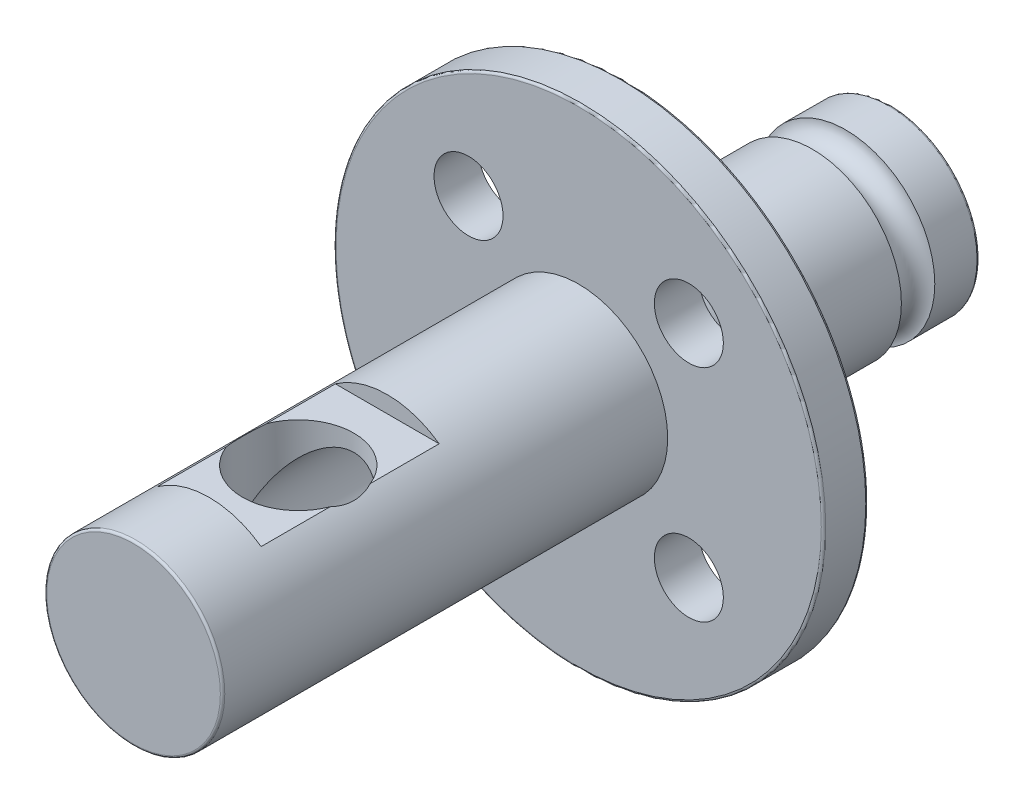
ISO-10303-21;
HEADER;
FILE_DESCRIPTION(('STEP AP214'),'2;1');
FILE_NAME('part.step','',(''),(''),'','','');
FILE_SCHEMA(('AUTOMOTIVE_DESIGN { 1 0 10303 214 1 1 1 1 }'));
ENDSEC;
DATA;
#1=APPLICATION_CONTEXT('core data for automotive mechanical design processes');
#2=APPLICATION_PROTOCOL_DEFINITION('international standard','automotive_design',2000,#1);
#3=PRODUCT_CONTEXT('',#1,'mechanical');
#4=PRODUCT('Part','Part','',(#3));
#5=PRODUCT_RELATED_PRODUCT_CATEGORY('part','',(#4));
#6=PRODUCT_DEFINITION_FORMATION('','',#4);
#7=PRODUCT_DEFINITION_CONTEXT('part definition',#1,'design');
#8=PRODUCT_DEFINITION('design','',#6,#7);
#9=PRODUCT_DEFINITION_SHAPE('','',#8);
#10=(LENGTH_UNIT() NAMED_UNIT(*) SI_UNIT(.MILLI.,.METRE.));
#11=(NAMED_UNIT(*) PLANE_ANGLE_UNIT() SI_UNIT($,.RADIAN.));
#12=(NAMED_UNIT(*) SI_UNIT($,.STERADIAN.) SOLID_ANGLE_UNIT());
#13=UNCERTAINTY_MEASURE_WITH_UNIT(LENGTH_MEASURE(1.E-05),#10,'distance_accuracy_value','');
#14=(GEOMETRIC_REPRESENTATION_CONTEXT(3) GLOBAL_UNCERTAINTY_ASSIGNED_CONTEXT((#13)) GLOBAL_UNIT_ASSIGNED_CONTEXT((#10,
#11,#12)) REPRESENTATION_CONTEXT('',''));
#15=CARTESIAN_POINT('',(0.,0.,0.));
#16=DIRECTION('',(0.,0.,1.));
#17=DIRECTION('',(1.,0.,0.));
#18=AXIS2_PLACEMENT_3D('',#15,#16,#17);
#19=CARTESIAN_POINT('',(0.,3.25,0.));
#20=DIRECTION('',(0.,-1.,0.));
#21=DIRECTION('',(0.,0.,-1.));
#22=AXIS2_PLACEMENT_3D('',#19,#20,#21);
#23=PLANE('',#22);
#24=DIRECTION('',(0.,0.,1.));
#25=VECTOR('',#24,1.);
#26=CARTESIAN_POINT('',(2.3318447632722,3.25,17.));
#27=LINE('',#26,#25);
#28=CARTESIAN_POINT('',(2.3318447632722,3.25,13.6));
#29=VERTEX_POINT('',#28);
#30=CARTESIAN_POINT('',(2.3318447632722,3.25,10.501387818866));
#31=VERTEX_POINT('',#30);
#32=EDGE_CURVE('E199',#29,#31,#27,.F.);
#33=ORIENTED_EDGE('',*,*,#32,.T.);
#34=CARTESIAN_POINT('',(0.,3.25,9.6));
#35=DIRECTION('',(0.,-1.,0.));
#36=DIRECTION('',(0.,0.,-1.));
#37=AXIS2_PLACEMENT_3D('',#34,#35,#36);
#38=CIRCLE('',#37,2.5);
#39=CARTESIAN_POINT('',(-2.3318447632722,3.25,10.501387818866));
#40=VERTEX_POINT('',#39);
#41=EDGE_CURVE('E11',#31,#40,#38,.T.);
#42=ORIENTED_EDGE('',*,*,#41,.T.);
#43=DIRECTION('',(0.,0.,1.));
#44=VECTOR('',#43,1.);
#45=CARTESIAN_POINT('',(-2.3318447632722,3.25,17.));
#46=LINE('',#45,#44);
#47=CARTESIAN_POINT('',(-2.3318447632722,3.25,13.6));
#48=VERTEX_POINT('',#47);
#49=EDGE_CURVE('E214',#40,#48,#46,.T.);
#50=ORIENTED_EDGE('',*,*,#49,.T.);
#51=DIRECTION('',(1.,0.,0.));
#52=VECTOR('',#51,1.);
#53=CARTESIAN_POINT('',(-2.5,3.25,13.6));
#54=LINE('',#53,#52);
#55=EDGE_CURVE('E202',#48,#29,#54,.T.);
#56=ORIENTED_EDGE('',*,*,#55,.T.);
#57=EDGE_LOOP('',(#33,#42,#50,#56));
#58=FACE_BOUND('',#57,.T.);
#59=ADVANCED_FACE('F48',(#58),#23,.F.);
#60=CARTESIAN_POINT('',(0.,-4.,-3.));
#61=DIRECTION('',(0.,0.,1.));
#62=DIRECTION('',(1.,0.,0.));
#63=AXIS2_PLACEMENT_3D('',#60,#61,#62);
#64=PLANE('',#63);
#65=CARTESIAN_POINT('',(0.,0.,-3.));
#66=DIRECTION('',(0.,0.,1.));
#67=DIRECTION('',(1.,0.,0.));
#68=AXIS2_PLACEMENT_3D('',#65,#66,#67);
#69=CIRCLE('',#68,10.9);
#70=CARTESIAN_POINT('',(10.9,0.,-3.));
#71=VERTEX_POINT('',#70);
#72=EDGE_CURVE('E229',#71,#71,#69,.T.);
#73=ORIENTED_EDGE('',*,*,#72,.T.);
#74=EDGE_LOOP('',(#73));
#75=FACE_BOUND('',#74,.T.);
#76=CARTESIAN_POINT('',(-4.94974746830588,-4.94974746830579,-3.));
#77=DIRECTION('',(0.,0.,1.));
#78=DIRECTION('',(1.,0.,0.));
#79=AXIS2_PLACEMENT_3D('',#76,#77,#78);
#80=CIRCLE('',#79,1.55);
#81=CARTESIAN_POINT('',(-3.39974746830587,-4.94974746830579,-3.));
#82=VERTEX_POINT('',#81);
#83=EDGE_CURVE('E290',#82,#82,#80,.T.);
#84=ORIENTED_EDGE('',*,*,#83,.F.);
#85=EDGE_LOOP('',(#84));
#86=FACE_BOUND('',#85,.T.);
#87=CARTESIAN_POINT('',(4.94974746830581,-4.94974746830586,-3.));
#88=DIRECTION('',(0.,0.,1.));
#89=DIRECTION('',(1.,0.,0.));
#90=AXIS2_PLACEMENT_3D('',#87,#88,#89);
#91=CIRCLE('',#90,1.55);
#92=CARTESIAN_POINT('',(6.49974746830581,-4.94974746830586,-3.));
#93=VERTEX_POINT('',#92);
#94=EDGE_CURVE('E294',#93,#93,#91,.T.);
#95=ORIENTED_EDGE('',*,*,#94,.F.);
#96=EDGE_LOOP('',(#95));
#97=FACE_BOUND('',#96,.T.);
#98=CARTESIAN_POINT('',(4.94974746830584,4.94974746830582,-3.));
#99=DIRECTION('',(0.,0.,1.));
#100=DIRECTION('',(1.,0.,0.));
#101=AXIS2_PLACEMENT_3D('',#98,#99,#100);
#102=CIRCLE('',#101,1.55);
#103=CARTESIAN_POINT('',(6.49974746830584,4.94974746830582,-3.));
#104=VERTEX_POINT('',#103);
#105=EDGE_CURVE('E289',#104,#104,#102,.T.);
#106=ORIENTED_EDGE('',*,*,#105,.F.);
#107=EDGE_LOOP('',(#106));
#108=FACE_BOUND('',#107,.T.);
#109=CARTESIAN_POINT('',(-4.94974746830584,4.94974746830582,-3.));
#110=DIRECTION('',(0.,0.,1.));
#111=DIRECTION('',(1.,0.,0.));
#112=AXIS2_PLACEMENT_3D('',#109,#110,#111);
#113=CIRCLE('',#112,1.55);
#114=CARTESIAN_POINT('',(-3.39974746830584,4.94974746830582,-3.));
#115=VERTEX_POINT('',#114);
#116=EDGE_CURVE('E271',#115,#115,#113,.T.);
#117=ORIENTED_EDGE('',*,*,#116,.F.);
#118=EDGE_LOOP('',(#117));
#119=FACE_BOUND('',#118,.T.);
#120=CARTESIAN_POINT('',(0.,0.,-3.));
#121=DIRECTION('',(0.,0.,1.));
#122=DIRECTION('',(1.,0.,0.));
#123=AXIS2_PLACEMENT_3D('',#120,#121,#122);
#124=CIRCLE('',#123,4.);
#125=CARTESIAN_POINT('',(4.,0.,-3.));
#126=VERTEX_POINT('',#125);
#127=EDGE_CURVE('E253',#126,#126,#124,.T.);
#128=ORIENTED_EDGE('',*,*,#127,.F.);
#129=EDGE_LOOP('',(#128));
#130=FACE_BOUND('',#129,.T.);
#131=ADVANCED_FACE('F187',(#75,#86,#97,#108,#119,#130),#64,.T.);
#132=CARTESIAN_POINT('',(0.,0.,17.));
#133=DIRECTION('',(0.,0.,1.));
#134=DIRECTION('',(1.,0.,0.));
#135=AXIS2_PLACEMENT_3D('',#132,#133,#134);
#136=CYLINDRICAL_SURFACE('',#135,4.);
#137=CARTESIAN_POINT('',(-2.3318447632722,3.25,8.69861218113401));
#138=CARTESIAN_POINT('',(-2.35212058302273,3.23545094828911,8.75107229883034));
#139=CARTESIAN_POINT('',(-2.37071160075321,3.22182658645101,8.80442824310383));
#140=CARTESIAN_POINT('',(-2.40436642988356,3.19678929465881,8.91279401949058));
#141=CARTESIAN_POINT('',(-2.41942733926326,3.18537818548835,8.96780517068708));
#142=CARTESIAN_POINT('',(-2.45895458338862,3.15510210712078,9.1346554506817));
#143=CARTESIAN_POINT('',(-2.47788667647815,3.14010445222921,9.24862216037378));
#144=CARTESIAN_POINT('',(-2.49981057204269,3.12268488518486,9.47964643909849));
#145=CARTESIAN_POINT('',(-2.50271691027379,3.12033039992166,9.59671724063432));
#146=CARTESIAN_POINT('',(-2.4921581585379,3.12876737924364,9.82960787339433));
#147=CARTESIAN_POINT('',(-2.47869977525005,3.13955345849471,9.94542819747562));
#148=CARTESIAN_POINT('',(-2.44327392358348,3.16713112663541,10.1352355400861));
#149=CARTESIAN_POINT('',(-2.42552215130219,3.18080999468614,10.2105289800985));
#150=CARTESIAN_POINT('',(-2.38347754259047,3.21243034120725,10.3582376004694));
#151=CARTESIAN_POINT('',(-2.35919374925204,3.23036592256852,10.4306566023929));
#152=CARTESIAN_POINT('',(-2.3318447632722,3.25,10.501387818866));
#153=B_SPLINE_CURVE_WITH_KNOTS('',3,(#137,#138,#139,#140,#141,#142,#143,#144,#145,#146,#147,
#148,#149,#150,#151,#152),.UNSPECIFIED.,.F.,.F.,(4,2,2,2,2,2,2,4),(0.,0.174209857347444,
0.348562430177187,0.696242801318246,1.04577554754894,1.39516509463678,1.6304226898858,
1.86535625021085),.UNSPECIFIED.);
#154=CARTESIAN_POINT('',(-2.3318447632722,3.25,8.698612181134));
#155=VERTEX_POINT('',#154);
#156=EDGE_CURVE('E104',#155,#40,#153,.T.);
#157=ORIENTED_EDGE('',*,*,#156,.F.);
#158=CARTESIAN_POINT('',(-2.3318447632722,3.25,5.6));
#159=VERTEX_POINT('',#158);
#160=EDGE_CURVE('E209',#159,#155,#46,.T.);
#161=ORIENTED_EDGE('',*,*,#160,.F.);
#162=CARTESIAN_POINT('',(0.,0.,5.6));
#163=DIRECTION('',(0.,0.,-1.));
#164=DIRECTION('',(-1.,0.,0.));
#165=AXIS2_PLACEMENT_3D('',#162,#163,#164);
#166=CIRCLE('',#165,4.);
#167=CARTESIAN_POINT('',(2.3318447632722,3.25,5.6));
#168=VERTEX_POINT('',#167);
#169=EDGE_CURVE('E218',#168,#159,#166,.F.);
#170=ORIENTED_EDGE('',*,*,#169,.F.);
#171=CARTESIAN_POINT('',(2.3318447632722,3.25,8.698612181134));
#172=VERTEX_POINT('',#171);
#173=EDGE_CURVE('E205',#172,#168,#27,.F.);
#174=ORIENTED_EDGE('',*,*,#173,.F.);
#175=CARTESIAN_POINT('',(2.3318447632722,3.25,10.501387818866));
#176=CARTESIAN_POINT('',(2.35212058302273,3.23545094828911,10.4489277011697));
#177=CARTESIAN_POINT('',(2.37071160075321,3.22182658645101,10.3955717568962));
#178=CARTESIAN_POINT('',(2.40436642988356,3.19678929465881,10.2872059805094));
#179=CARTESIAN_POINT('',(2.41942733926326,3.18537818548835,10.2321948293129));
#180=CARTESIAN_POINT('',(2.45895458338862,3.15510210712078,10.0653445493183));
#181=CARTESIAN_POINT('',(2.47788667647815,3.14010445222921,9.95137783962622));
#182=CARTESIAN_POINT('',(2.49981057204269,3.12268488518486,9.72035356090151));
#183=CARTESIAN_POINT('',(2.50271691027379,3.12033039992166,9.60328275936569));
#184=CARTESIAN_POINT('',(2.4921581585379,3.12876737924364,9.37039212660567));
#185=CARTESIAN_POINT('',(2.47869977525005,3.13955345849471,9.25457180252438));
#186=CARTESIAN_POINT('',(2.44327392358348,3.16713112663541,9.06476445991388));
#187=CARTESIAN_POINT('',(2.42552215130219,3.18080999468614,8.9894710199015));
#188=CARTESIAN_POINT('',(2.38347754259047,3.21243034120725,8.84176239953057));
#189=CARTESIAN_POINT('',(2.35919374925204,3.23036592256852,8.76934339760711));
#190=CARTESIAN_POINT('',(2.3318447632722,3.25,8.69861218113401));
#191=B_SPLINE_CURVE_WITH_KNOTS('',3,(#175,#176,#177,#178,#179,#180,#181,#182,#183,#184,#185,
#186,#187,#188,#189,#190),.UNSPECIFIED.,.F.,.F.,(4,2,2,2,2,2,2,4),(0.,0.174209857347444,
0.348562430177187,0.696242801318246,1.04577554754894,1.39516509463678,1.6304226898858,
1.86535625021085),.UNSPECIFIED.);
#192=EDGE_CURVE('E71',#31,#172,#191,.T.);
#193=ORIENTED_EDGE('',*,*,#192,.F.);
#194=ORIENTED_EDGE('',*,*,#32,.F.);
#195=CARTESIAN_POINT('',(0.,0.,13.6));
#196=DIRECTION('',(0.,0.,1.));
#197=DIRECTION('',(1.,0.,0.));
#198=AXIS2_PLACEMENT_3D('',#195,#196,#197);
#199=CIRCLE('',#198,4.);
#200=EDGE_CURVE('E215',#48,#29,#199,.F.);
#201=ORIENTED_EDGE('',*,*,#200,.F.);
#202=ORIENTED_EDGE('',*,*,#49,.F.);
#203=EDGE_LOOP('',(#157,#161,#170,#174,#193,#194,#201,#202));
#204=FACE_BOUND('',#203,.T.);
#205=CARTESIAN_POINT('',(0.,0.,16.9));
#206=DIRECTION('',(0.,0.,1.));
#207=DIRECTION('',(1.,0.,0.));
#208=AXIS2_PLACEMENT_3D('',#205,#206,#207);
#209=CIRCLE('',#208,4.);
#210=CARTESIAN_POINT('',(4.,0.,16.9));
#211=VERTEX_POINT('',#210);
#212=EDGE_CURVE('E222',#211,#211,#209,.F.);
#213=ORIENTED_EDGE('',*,*,#212,.T.);
#214=EDGE_LOOP('',(#213));
#215=FACE_BOUND('',#214,.T.);
#216=ORIENTED_EDGE('',*,*,#127,.T.);
#217=EDGE_LOOP('',(#216));
#218=FACE_BOUND('',#217,.T.);
#219=ADVANCED_FACE('F119',(#204,#215,#218),#136,.T.);
#220=CARTESIAN_POINT('',(0.,0.,17.));
#221=DIRECTION('',(0.,0.,1.));
#222=DIRECTION('',(1.,0.,0.));
#223=AXIS2_PLACEMENT_3D('',#220,#221,#222);
#224=PLANE('',#223);
#225=CARTESIAN_POINT('',(0.,0.,17.));
#226=DIRECTION('',(0.,0.,1.));
#227=DIRECTION('',(1.,0.,0.));
#228=AXIS2_PLACEMENT_3D('',#225,#226,#227);
#229=CIRCLE('',#228,3.9);
#230=CARTESIAN_POINT('',(3.9,0.,17.));
#231=VERTEX_POINT('',#230);
#232=EDGE_CURVE('E226',#231,#231,#229,.T.);
#233=ORIENTED_EDGE('',*,*,#232,.T.);
#234=EDGE_LOOP('',(#233));
#235=FACE_BOUND('',#234,.T.);
#236=ADVANCED_FACE('F180',(#235),#224,.T.);
#237=CARTESIAN_POINT('',(0.,0.,-17.));
#238=DIRECTION('',(0.,0.,-1.));
#239=DIRECTION('',(-1.,0.,0.));
#240=AXIS2_PLACEMENT_3D('',#237,#238,#239);
#241=PLANE('',#240);
#242=CARTESIAN_POINT('',(0.,0.,-17.));
#243=DIRECTION('',(0.,0.,-1.));
#244=DIRECTION('',(-1.,0.,0.));
#245=AXIS2_PLACEMENT_3D('',#242,#243,#244);
#246=CIRCLE('',#245,2.5);
#247=CARTESIAN_POINT('',(-2.5,0.,-17.));
#248=VERTEX_POINT('',#247);
#249=EDGE_CURVE('E650',#248,#248,#246,.T.);
#250=ORIENTED_EDGE('',*,*,#249,.F.);
#251=EDGE_LOOP('',(#250));
#252=FACE_BOUND('',#251,.T.);
#253=CARTESIAN_POINT('',(0.,0.,-17.));
#254=DIRECTION('',(0.,0.,-1.));
#255=DIRECTION('',(-1.,0.,0.));
#256=AXIS2_PLACEMENT_3D('',#253,#254,#255);
#257=CIRCLE('',#256,3.89999999999999);
#258=CARTESIAN_POINT('',(-3.89999999999999,0.,-17.));
#259=VERTEX_POINT('',#258);
#260=EDGE_CURVE('E245',#259,#259,#257,.T.);
#261=ORIENTED_EDGE('',*,*,#260,.T.);
#262=EDGE_LOOP('',(#261));
#263=FACE_BOUND('',#262,.T.);
#264=ADVANCED_FACE('F177',(#252,#263),#241,.T.);
#265=CARTESIAN_POINT('',(0.,0.,17.));
#266=DIRECTION('',(0.,0.,1.));
#267=DIRECTION('',(1.,0.,0.));
#268=AXIS2_PLACEMENT_3D('',#265,#266,#267);
#269=CYLINDRICAL_SURFACE('',#268,3.99999999999999);
#270=CARTESIAN_POINT('',(0.,0.,-16.9));
#271=DIRECTION('',(0.,0.,-1.));
#272=DIRECTION('',(-1.,0.,0.));
#273=AXIS2_PLACEMENT_3D('',#270,#271,#272);
#274=CIRCLE('',#273,3.99999999999999);
#275=CARTESIAN_POINT('',(-3.99999999999999,0.,-16.9));
#276=VERTEX_POINT('',#275);
#277=EDGE_CURVE('E249',#276,#276,#274,.F.);
#278=ORIENTED_EDGE('',*,*,#277,.T.);
#279=EDGE_LOOP('',(#278));
#280=FACE_BOUND('',#279,.T.);
#281=CARTESIAN_POINT('',(0.,0.,-15.));
#282=DIRECTION('',(0.,0.,1.));
#283=DIRECTION('',(1.,0.,0.));
#284=AXIS2_PLACEMENT_3D('',#281,#282,#283);
#285=CIRCLE('',#284,3.99999999999999);
#286=CARTESIAN_POINT('',(3.99999999999999,0.,-15.));
#287=VERTEX_POINT('',#286);
#288=EDGE_CURVE('E275',#287,#287,#285,.T.);
#289=ORIENTED_EDGE('',*,*,#288,.F.);
#290=EDGE_LOOP('',(#289));
#291=FACE_BOUND('',#290,.T.);
#292=ADVANCED_FACE('F173',(#280,#291),#269,.T.);
#293=CARTESIAN_POINT('',(0.,0.,-14.25));
#294=DIRECTION('',(0.,0.,1.));
#295=DIRECTION('',(1.,0.,0.));
#296=AXIS2_PLACEMENT_3D('',#293,#294,#295);
#297=TOROIDAL_SURFACE('',#296,4.,0.750000000000001);
#298=ORIENTED_EDGE('',*,*,#288,.T.);
#299=EDGE_LOOP('',(#298));
#300=FACE_BOUND('',#299,.T.);
#301=CARTESIAN_POINT('',(0.,0.,-13.5));
#302=DIRECTION('',(0.,0.,1.));
#303=DIRECTION('',(1.,0.,0.));
#304=AXIS2_PLACEMENT_3D('',#301,#302,#303);
#305=CIRCLE('',#304,3.99999999999999);
#306=CARTESIAN_POINT('',(3.99999999999999,0.,-13.5));
#307=VERTEX_POINT('',#306);
#308=EDGE_CURVE('E279',#307,#307,#305,.T.);
#309=ORIENTED_EDGE('',*,*,#308,.F.);
#310=EDGE_LOOP('',(#309));
#311=FACE_BOUND('',#310,.T.);
#312=ADVANCED_FACE('F169',(#300,#311),#297,.F.);
#313=CARTESIAN_POINT('',(0.,0.,17.));
#314=DIRECTION('',(0.,0.,1.));
#315=DIRECTION('',(1.,0.,0.));
#316=AXIS2_PLACEMENT_3D('',#313,#314,#315);
#317=CYLINDRICAL_SURFACE('',#316,3.99999999999999);
#318=ORIENTED_EDGE('',*,*,#308,.T.);
#319=EDGE_LOOP('',(#318));
#320=FACE_BOUND('',#319,.T.);
#321=CARTESIAN_POINT('',(0.,0.,-5.));
#322=DIRECTION('',(0.,0.,1.));
#323=DIRECTION('',(1.,0.,0.));
#324=AXIS2_PLACEMENT_3D('',#321,#322,#323);
#325=CIRCLE('',#324,3.99999999999999);
#326=CARTESIAN_POINT('',(3.99999999999999,0.,-5.));
#327=VERTEX_POINT('',#326);
#328=EDGE_CURVE('E258',#327,#327,#325,.T.);
#329=ORIENTED_EDGE('',*,*,#328,.F.);
#330=EDGE_LOOP('',(#329));
#331=FACE_BOUND('',#330,.T.);
#332=ADVANCED_FACE('F165',(#320,#331),#317,.T.);
#333=CARTESIAN_POINT('',(0.,-11.,-5.));
#334=DIRECTION('',(0.,0.,-1.));
#335=DIRECTION('',(-1.,0.,0.));
#336=AXIS2_PLACEMENT_3D('',#333,#334,#335);
#337=PLANE('',#336);
#338=CARTESIAN_POINT('',(0.,0.,-5.));
#339=DIRECTION('',(0.,0.,-1.));
#340=DIRECTION('',(-1.,0.,0.));
#341=AXIS2_PLACEMENT_3D('',#338,#339,#340);
#342=CIRCLE('',#341,10.9);
#343=CARTESIAN_POINT('',(-10.9,0.,-5.));
#344=VERTEX_POINT('',#343);
#345=EDGE_CURVE('E233',#344,#344,#342,.T.);
#346=ORIENTED_EDGE('',*,*,#345,.T.);
#347=EDGE_LOOP('',(#346));
#348=FACE_BOUND('',#347,.T.);
#349=CARTESIAN_POINT('',(-4.94974746830588,-4.94974746830579,-5.));
#350=DIRECTION('',(0.,0.,-1.));
#351=DIRECTION('',(-1.,0.,0.));
#352=AXIS2_PLACEMENT_3D('',#349,#350,#351);
#353=CIRCLE('',#352,1.55);
#354=CARTESIAN_POINT('',(-6.49974746830588,-4.94974746830579,-5.));
#355=VERTEX_POINT('',#354);
#356=EDGE_CURVE('E254',#355,#355,#353,.T.);
#357=ORIENTED_EDGE('',*,*,#356,.F.);
#358=EDGE_LOOP('',(#357));
#359=FACE_BOUND('',#358,.T.);
#360=CARTESIAN_POINT('',(4.94974746830581,-4.94974746830586,-5.));
#361=DIRECTION('',(0.,0.,-1.));
#362=DIRECTION('',(-1.,0.,0.));
#363=AXIS2_PLACEMENT_3D('',#360,#361,#362);
#364=CIRCLE('',#363,1.55);
#365=CARTESIAN_POINT('',(3.39974746830581,-4.94974746830586,-5.));
#366=VERTEX_POINT('',#365);
#367=EDGE_CURVE('E259',#366,#366,#364,.T.);
#368=ORIENTED_EDGE('',*,*,#367,.F.);
#369=EDGE_LOOP('',(#368));
#370=FACE_BOUND('',#369,.T.);
#371=CARTESIAN_POINT('',(4.94974746830584,4.94974746830582,-5.));
#372=DIRECTION('',(0.,0.,-1.));
#373=DIRECTION('',(-1.,0.,0.));
#374=AXIS2_PLACEMENT_3D('',#371,#372,#373);
#375=CIRCLE('',#374,1.55);
#376=CARTESIAN_POINT('',(3.39974746830584,4.94974746830582,-5.));
#377=VERTEX_POINT('',#376);
#378=EDGE_CURVE('E263',#377,#377,#375,.T.);
#379=ORIENTED_EDGE('',*,*,#378,.F.);
#380=EDGE_LOOP('',(#379));
#381=FACE_BOUND('',#380,.T.);
#382=CARTESIAN_POINT('',(-4.94974746830584,4.94974746830582,-5.));
#383=DIRECTION('',(0.,0.,-1.));
#384=DIRECTION('',(-1.,0.,0.));
#385=AXIS2_PLACEMENT_3D('',#382,#383,#384);
#386=CIRCLE('',#385,1.55);
#387=CARTESIAN_POINT('',(-6.49974746830584,4.94974746830582,-5.));
#388=VERTEX_POINT('',#387);
#389=EDGE_CURVE('E267',#388,#388,#386,.T.);
#390=ORIENTED_EDGE('',*,*,#389,.F.);
#391=EDGE_LOOP('',(#390));
#392=FACE_BOUND('',#391,.T.);
#393=ORIENTED_EDGE('',*,*,#328,.T.);
#394=EDGE_LOOP('',(#393));
#395=FACE_BOUND('',#394,.T.);
#396=ADVANCED_FACE('F161',(#348,#359,#370,#381,#392,#395),#337,.T.);
#397=CARTESIAN_POINT('',(0.,0.,17.));
#398=DIRECTION('',(0.,0.,1.));
#399=DIRECTION('',(1.,0.,0.));
#400=AXIS2_PLACEMENT_3D('',#397,#398,#399);
#401=CYLINDRICAL_SURFACE('',#400,11.);
#402=CARTESIAN_POINT('',(0.,0.,-4.9));
#403=DIRECTION('',(0.,0.,-1.));
#404=DIRECTION('',(-1.,0.,0.));
#405=AXIS2_PLACEMENT_3D('',#402,#403,#404);
#406=CIRCLE('',#405,11.);
#407=CARTESIAN_POINT('',(-11.,0.,-4.9));
#408=VERTEX_POINT('',#407);
#409=EDGE_CURVE('E237',#408,#408,#406,.F.);
#410=ORIENTED_EDGE('',*,*,#409,.T.);
#411=EDGE_LOOP('',(#410));
#412=FACE_BOUND('',#411,.T.);
#413=CARTESIAN_POINT('',(0.,0.,-3.1));
#414=DIRECTION('',(0.,0.,1.));
#415=DIRECTION('',(1.,0.,0.));
#416=AXIS2_PLACEMENT_3D('',#413,#414,#415);
#417=CIRCLE('',#416,11.);
#418=CARTESIAN_POINT('',(11.,0.,-3.1));
#419=VERTEX_POINT('',#418);
#420=EDGE_CURVE('E241',#419,#419,#417,.F.);
#421=ORIENTED_EDGE('',*,*,#420,.T.);
#422=EDGE_LOOP('',(#421));
#423=FACE_BOUND('',#422,.T.);
#424=ADVANCED_FACE('F157',(#412,#423),#401,.T.);
#425=CARTESIAN_POINT('',(-4.94974746830584,4.94974746830582,-13.));
#426=DIRECTION('',(0.,0.,1.));
#427=DIRECTION('',(1.,0.,0.));
#428=AXIS2_PLACEMENT_3D('',#425,#426,#427);
#429=CYLINDRICAL_SURFACE('',#428,1.55);
#430=ORIENTED_EDGE('',*,*,#389,.T.);
#431=EDGE_LOOP('',(#430));
#432=FACE_BOUND('',#431,.T.);
#433=ORIENTED_EDGE('',*,*,#116,.T.);
#434=EDGE_LOOP('',(#433));
#435=FACE_BOUND('',#434,.T.);
#436=ADVANCED_FACE('F145',(#432,#435),#429,.F.);
#437=CARTESIAN_POINT('',(4.94974746830584,4.94974746830582,-13.));
#438=DIRECTION('',(0.,0.,1.));
#439=DIRECTION('',(1.,0.,0.));
#440=AXIS2_PLACEMENT_3D('',#437,#438,#439);
#441=CYLINDRICAL_SURFACE('',#440,1.55);
#442=ORIENTED_EDGE('',*,*,#378,.T.);
#443=EDGE_LOOP('',(#442));
#444=FACE_BOUND('',#443,.T.);
#445=ORIENTED_EDGE('',*,*,#105,.T.);
#446=EDGE_LOOP('',(#445));
#447=FACE_BOUND('',#446,.T.);
#448=ADVANCED_FACE('F141',(#444,#447),#441,.F.);
#449=CARTESIAN_POINT('',(4.94974746830581,-4.94974746830586,-13.));
#450=DIRECTION('',(0.,0.,1.));
#451=DIRECTION('',(1.,0.,0.));
#452=AXIS2_PLACEMENT_3D('',#449,#450,#451);
#453=CYLINDRICAL_SURFACE('',#452,1.55);
#454=ORIENTED_EDGE('',*,*,#367,.T.);
#455=EDGE_LOOP('',(#454));
#456=FACE_BOUND('',#455,.T.);
#457=ORIENTED_EDGE('',*,*,#94,.T.);
#458=EDGE_LOOP('',(#457));
#459=FACE_BOUND('',#458,.T.);
#460=ADVANCED_FACE('F144',(#456,#459),#453,.F.);
#461=CARTESIAN_POINT('',(-4.94974746830588,-4.94974746830579,-13.));
#462=DIRECTION('',(0.,0.,1.));
#463=DIRECTION('',(1.,0.,0.));
#464=AXIS2_PLACEMENT_3D('',#461,#462,#463);
#465=CYLINDRICAL_SURFACE('',#464,1.55);
#466=ORIENTED_EDGE('',*,*,#356,.T.);
#467=EDGE_LOOP('',(#466));
#468=FACE_BOUND('',#467,.T.);
#469=ORIENTED_EDGE('',*,*,#83,.T.);
#470=EDGE_LOOP('',(#469));
#471=FACE_BOUND('',#470,.T.);
#472=ADVANCED_FACE('F149',(#468,#471),#465,.F.);
#473=CARTESIAN_POINT('',(0.,0.,-16.9));
#474=DIRECTION('',(0.,0.,-1.));
#475=DIRECTION('',(-1.,0.,0.));
#476=AXIS2_PLACEMENT_3D('',#473,#474,#475);
#477=TOROIDAL_SURFACE('',#476,3.89999999999999,0.1);
#478=ORIENTED_EDGE('',*,*,#260,.F.);
#479=EDGE_LOOP('',(#478));
#480=FACE_BOUND('',#479,.T.);
#481=ORIENTED_EDGE('',*,*,#277,.F.);
#482=EDGE_LOOP('',(#481));
#483=FACE_BOUND('',#482,.T.);
#484=ADVANCED_FACE('F153',(#480,#483),#477,.T.);
#485=CARTESIAN_POINT('',(0.,0.,-4.9));
#486=DIRECTION('',(0.,0.,-1.));
#487=DIRECTION('',(-1.,0.,0.));
#488=AXIS2_PLACEMENT_3D('',#485,#486,#487);
#489=TOROIDAL_SURFACE('',#488,10.9,0.1);
#490=ORIENTED_EDGE('',*,*,#345,.F.);
#491=EDGE_LOOP('',(#490));
#492=FACE_BOUND('',#491,.T.);
#493=ORIENTED_EDGE('',*,*,#409,.F.);
#494=EDGE_LOOP('',(#493));
#495=FACE_BOUND('',#494,.T.);
#496=ADVANCED_FACE('F387',(#492,#495),#489,.T.);
#497=CARTESIAN_POINT('',(0.,0.,-3.1));
#498=DIRECTION('',(0.,0.,1.));
#499=DIRECTION('',(1.,0.,0.));
#500=AXIS2_PLACEMENT_3D('',#497,#498,#499);
#501=TOROIDAL_SURFACE('',#500,10.9,0.1);
#502=ORIENTED_EDGE('',*,*,#420,.F.);
#503=EDGE_LOOP('',(#502));
#504=FACE_BOUND('',#503,.T.);
#505=ORIENTED_EDGE('',*,*,#72,.F.);
#506=EDGE_LOOP('',(#505));
#507=FACE_BOUND('',#506,.T.);
#508=ADVANCED_FACE('F382',(#504,#507),#501,.T.);
#509=CARTESIAN_POINT('',(0.,0.,16.9));
#510=DIRECTION('',(0.,0.,1.));
#511=DIRECTION('',(1.,0.,0.));
#512=AXIS2_PLACEMENT_3D('',#509,#510,#511);
#513=TOROIDAL_SURFACE('',#512,3.9,0.1);
#514=ORIENTED_EDGE('',*,*,#212,.F.);
#515=EDGE_LOOP('',(#514));
#516=FACE_BOUND('',#515,.T.);
#517=ORIENTED_EDGE('',*,*,#232,.F.);
#518=EDGE_LOOP('',(#517));
#519=FACE_BOUND('',#518,.T.);
#520=ADVANCED_FACE('F50',(#516,#519),#513,.T.);
#521=CARTESIAN_POINT('',(-2.5,3.25,13.6));
#522=DIRECTION('',(0.,0.,1.));
#523=DIRECTION('',(1.,0.,0.));
#524=AXIS2_PLACEMENT_3D('',#521,#522,#523);
#525=PLANE('',#524);
#526=ORIENTED_EDGE('',*,*,#55,.F.);
#527=ORIENTED_EDGE('',*,*,#200,.T.);
#528=EDGE_LOOP('',(#526,#527));
#529=FACE_BOUND('',#528,.T.);
#530=ADVANCED_FACE('F134',(#529),#525,.F.);
#531=CARTESIAN_POINT('',(-2.5,3.25,5.6));
#532=DIRECTION('',(0.,0.,-1.));
#533=DIRECTION('',(-1.,0.,0.));
#534=AXIS2_PLACEMENT_3D('',#531,#532,#533);
#535=PLANE('',#534);
#536=DIRECTION('',(-1.,0.,0.));
#537=VECTOR('',#536,1.);
#538=CARTESIAN_POINT('',(-2.5,3.25,5.6));
#539=LINE('',#538,#537);
#540=EDGE_CURVE('E302',#168,#159,#539,.T.);
#541=ORIENTED_EDGE('',*,*,#540,.F.);
#542=ORIENTED_EDGE('',*,*,#169,.T.);
#543=EDGE_LOOP('',(#541,#542));
#544=FACE_BOUND('',#543,.T.);
#545=ADVANCED_FACE('F132',(#544),#535,.F.);
#546=ORIENTED_EDGE('',*,*,#160,.T.);
#547=EDGE_CURVE('E52',#155,#172,#38,.T.);
#548=ORIENTED_EDGE('',*,*,#547,.T.);
#549=ORIENTED_EDGE('',*,*,#173,.T.);
#550=ORIENTED_EDGE('',*,*,#540,.T.);
#551=EDGE_LOOP('',(#546,#548,#549,#550));
#552=FACE_BOUND('',#551,.T.);
#553=ADVANCED_FACE('F127',(#552),#23,.F.);
#554=CARTESIAN_POINT('',(0.,0.,9.6));
#555=DIRECTION('',(0.,1.,0.));
#556=DIRECTION('',(0.,0.,1.));
#557=AXIS2_PLACEMENT_3D('',#554,#555,#556);
#558=CYLINDRICAL_SURFACE('',#557,2.5);
#559=ORIENTED_EDGE('',*,*,#156,.T.);
#560=ORIENTED_EDGE('',*,*,#41,.F.);
#561=ORIENTED_EDGE('',*,*,#192,.T.);
#562=ORIENTED_EDGE('',*,*,#547,.F.);
#563=EDGE_LOOP('',(#559,#560,#561,#562));
#564=FACE_BOUND('',#563,.T.);
#565=CARTESIAN_POINT('',(0.,0.,9.6));
#566=DIRECTION('',(0.,0.707106781186547,0.707106781186548));
#567=DIRECTION('',(0.,0.707106781186547,-0.707106781186548));
#568=AXIS2_PLACEMENT_3D('',#565,#566,#567);
#569=ELLIPSE('',#568,3.53553390593274,2.5);
#570=CARTESIAN_POINT('',(-2.5,0.,9.6));
#571=VERTEX_POINT('',#570);
#572=CARTESIAN_POINT('',(2.5,0.,9.6));
#573=VERTEX_POINT('',#572);
#574=EDGE_CURVE('E94',#571,#573,#569,.F.);
#575=ORIENTED_EDGE('',*,*,#574,.T.);
#576=CARTESIAN_POINT('',(0.,0.,9.6));
#577=DIRECTION('',(0.,0.707106781186547,-0.707106781186548));
#578=DIRECTION('',(0.,0.707106781186547,0.707106781186548));
#579=AXIS2_PLACEMENT_3D('',#576,#577,#578);
#580=ELLIPSE('',#579,3.53553390593274,2.5);
#581=EDGE_CURVE('E63',#573,#571,#580,.F.);
#582=ORIENTED_EDGE('',*,*,#581,.T.);
#583=EDGE_LOOP('',(#575,#582));
#584=FACE_BOUND('',#583,.T.);
#585=ADVANCED_FACE('F100',(#564,#584),#558,.F.);
#586=CARTESIAN_POINT('',(0.,0.,13.));
#587=DIRECTION('',(0.,0.,-1.));
#588=DIRECTION('',(-1.,0.,0.));
#589=AXIS2_PLACEMENT_3D('',#586,#587,#588);
#590=CYLINDRICAL_SURFACE('',#589,2.5);
#591=CARTESIAN_POINT('',(0.,0.,13.));
#592=DIRECTION('',(0.,0.,-1.));
#593=DIRECTION('',(-1.,0.,0.));
#594=AXIS2_PLACEMENT_3D('',#591,#592,#593);
#595=CIRCLE('',#594,2.5);
#596=CARTESIAN_POINT('',(-2.5,0.,13.));
#597=VERTEX_POINT('',#596);
#598=EDGE_CURVE('E98',#597,#597,#595,.T.);
#599=ORIENTED_EDGE('',*,*,#598,.F.);
#600=EDGE_LOOP('',(#599));
#601=FACE_BOUND('',#600,.T.);
#602=ORIENTED_EDGE('',*,*,#249,.T.);
#603=EDGE_LOOP('',(#602));
#604=FACE_BOUND('',#603,.T.);
#605=ORIENTED_EDGE('',*,*,#574,.F.);
#606=ORIENTED_EDGE('',*,*,#581,.F.);
#607=EDGE_LOOP('',(#605,#606));
#608=FACE_BOUND('',#607,.T.);
#609=ADVANCED_FACE('F95',(#601,#604,#608),#590,.F.);
#610=CARTESIAN_POINT('',(0.,0.,13.));
#611=DIRECTION('',(0.,0.,-1.));
#612=DIRECTION('',(-1.,0.,0.));
#613=AXIS2_PLACEMENT_3D('',#610,#611,#612);
#614=PLANE('',#613);
#615=ORIENTED_EDGE('',*,*,#598,.T.);
#616=EDGE_LOOP('',(#615));
#617=FACE_BOUND('',#616,.T.);
#618=ADVANCED_FACE('F462',(#617),#614,.T.);
#619=CLOSED_SHELL('',(#59,#131,#219,#236,#264,#292,#312,#332,#396,#424,#436,#448,#460,#472,#484,
#496,#508,#520,#530,#545,#553,#585,#609,#618));
#620=MANIFOLD_SOLID_BREP('B2',#619);
#621=ADVANCED_BREP_SHAPE_REPRESENTATION('',(#18,#620),#14);
#622=SHAPE_DEFINITION_REPRESENTATION(#9,#621);
ENDSEC;
END-ISO-10303-21;
